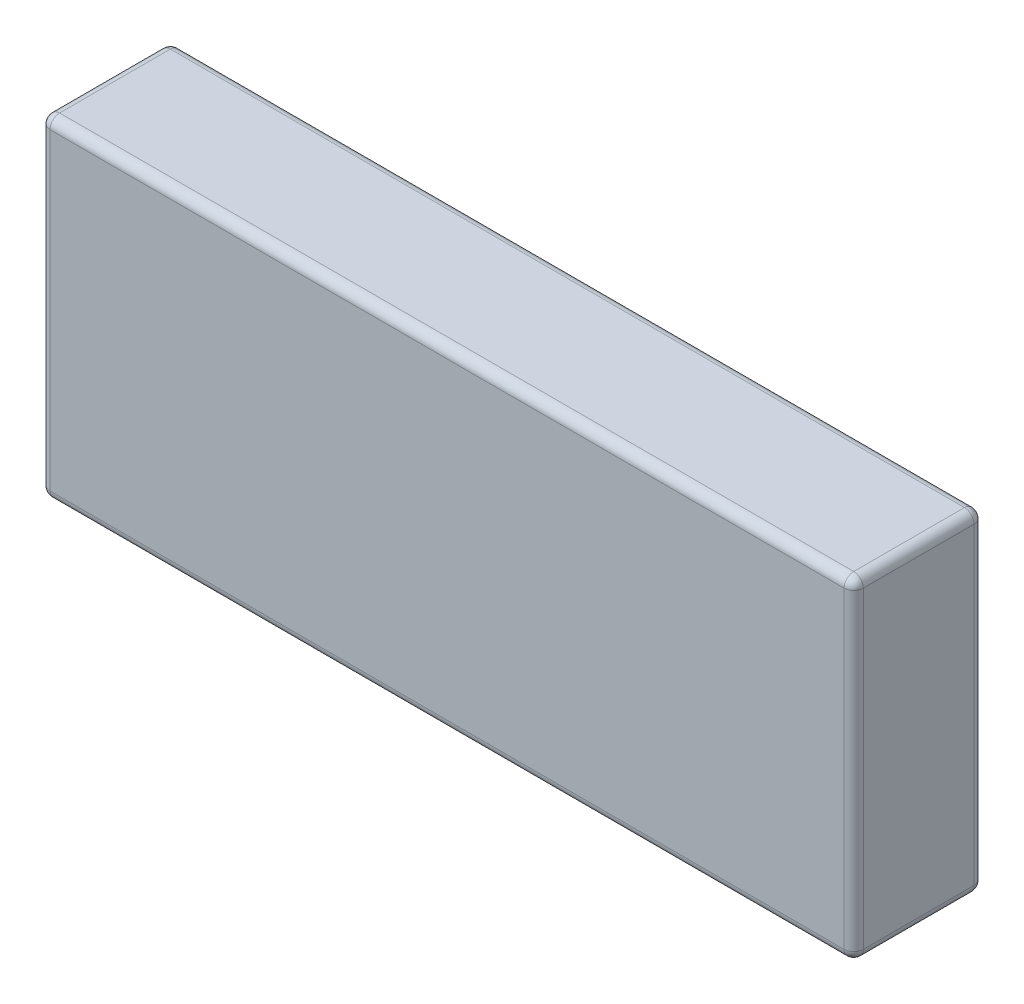
ISO-10303-21;
HEADER;
FILE_DESCRIPTION(('STEP AP214'),'2;1');
FILE_NAME('part.step','',(''),(''),'','','');
FILE_SCHEMA(('AUTOMOTIVE_DESIGN { 1 0 10303 214 1 1 1 1 }'));
ENDSEC;
DATA;
#1=APPLICATION_CONTEXT('core data for automotive mechanical design processes');
#2=APPLICATION_PROTOCOL_DEFINITION('international standard','automotive_design',2000,#1);
#3=PRODUCT_CONTEXT('',#1,'mechanical');
#4=PRODUCT('Part','Part','',(#3));
#5=PRODUCT_RELATED_PRODUCT_CATEGORY('part','',(#4));
#6=PRODUCT_DEFINITION_FORMATION('','',#4);
#7=PRODUCT_DEFINITION_CONTEXT('part definition',#1,'design');
#8=PRODUCT_DEFINITION('design','',#6,#7);
#9=PRODUCT_DEFINITION_SHAPE('','',#8);
#10=(LENGTH_UNIT() NAMED_UNIT(*) SI_UNIT(.MILLI.,.METRE.));
#11=(NAMED_UNIT(*) PLANE_ANGLE_UNIT() SI_UNIT($,.RADIAN.));
#12=(NAMED_UNIT(*) SI_UNIT($,.STERADIAN.) SOLID_ANGLE_UNIT());
#13=UNCERTAINTY_MEASURE_WITH_UNIT(LENGTH_MEASURE(1.E-05),#10,'distance_accuracy_value','');
#14=(GEOMETRIC_REPRESENTATION_CONTEXT(3) GLOBAL_UNCERTAINTY_ASSIGNED_CONTEXT((#13)) GLOBAL_UNIT_ASSIGNED_CONTEXT((#10,
#11,#12)) REPRESENTATION_CONTEXT('',''));
#15=CARTESIAN_POINT('',(0.,0.,0.));
#16=DIRECTION('',(0.,0.,1.));
#17=DIRECTION('',(1.,0.,0.));
#18=AXIS2_PLACEMENT_3D('',#15,#16,#17);
#19=CARTESIAN_POINT('',(0.,69.,0.));
#20=DIRECTION('',(1.,0.,0.));
#21=DIRECTION('',(0.,0.,-1.));
#22=AXIS2_PLACEMENT_3D('',#19,#20,#21);
#23=PLANE('',#22);
#24=DIRECTION('',(0.,0.,1.));
#25=VECTOR('',#24,1.);
#26=CARTESIAN_POINT('',(0.,2.,0.));
#27=LINE('',#26,#25);
#28=CARTESIAN_POINT('',(0.,2.,-25.));
#29=VERTEX_POINT('',#28);
#30=CARTESIAN_POINT('',(0.,2.,-2.));
#31=VERTEX_POINT('',#30);
#32=EDGE_CURVE('E181',#29,#31,#27,.T.);
#33=ORIENTED_EDGE('',*,*,#32,.T.);
#34=DIRECTION('',(0.,-1.,0.));
#35=VECTOR('',#34,1.);
#36=CARTESIAN_POINT('',(0.,69.,-2.));
#37=LINE('',#36,#35);
#38=CARTESIAN_POINT('',(0.,67.,-2.));
#39=VERTEX_POINT('',#38);
#40=EDGE_CURVE('E183',#31,#39,#37,.F.);
#41=ORIENTED_EDGE('',*,*,#40,.T.);
#42=DIRECTION('',(0.,0.,1.));
#43=VECTOR('',#42,1.);
#44=CARTESIAN_POINT('',(0.,67.,0.));
#45=LINE('',#44,#43);
#46=CARTESIAN_POINT('',(0.,67.,-25.));
#47=VERTEX_POINT('',#46);
#48=EDGE_CURVE('E179',#39,#47,#45,.F.);
#49=ORIENTED_EDGE('',*,*,#48,.T.);
#50=DIRECTION('',(0.,-1.,0.));
#51=VECTOR('',#50,1.);
#52=CARTESIAN_POINT('',(0.,69.,-25.));
#53=LINE('',#52,#51);
#54=EDGE_CURVE('E177',#47,#29,#53,.T.);
#55=ORIENTED_EDGE('',*,*,#54,.T.);
#56=EDGE_LOOP('',(#33,#41,#49,#55));
#57=FACE_BOUND('',#56,.T.);
#58=ADVANCED_FACE('F40',(#57),#23,.F.);
#59=CARTESIAN_POINT('',(0.,69.,0.));
#60=DIRECTION('',(0.,0.,-1.));
#61=DIRECTION('',(-1.,0.,0.));
#62=AXIS2_PLACEMENT_3D('',#59,#60,#61);
#63=PLANE('',#62);
#64=DIRECTION('',(0.,-1.,0.));
#65=VECTOR('',#64,1.);
#66=CARTESIAN_POINT('',(2.,69.,0.));
#67=LINE('',#66,#65);
#68=CARTESIAN_POINT('',(2.,67.,0.));
#69=VERTEX_POINT('',#68);
#70=CARTESIAN_POINT('',(2.,2.,0.));
#71=VERTEX_POINT('',#70);
#72=EDGE_CURVE('E143',#69,#71,#67,.T.);
#73=ORIENTED_EDGE('',*,*,#72,.T.);
#74=DIRECTION('',(1.,0.,0.));
#75=VECTOR('',#74,1.);
#76=CARTESIAN_POINT('',(169.,2.,0.));
#77=LINE('',#76,#75);
#78=CARTESIAN_POINT('',(167.,2.,0.));
#79=VERTEX_POINT('',#78);
#80=EDGE_CURVE('E138',#71,#79,#77,.T.);
#81=ORIENTED_EDGE('',*,*,#80,.T.);
#82=DIRECTION('',(0.,-1.,0.));
#83=VECTOR('',#82,1.);
#84=CARTESIAN_POINT('',(167.,69.,0.));
#85=LINE('',#84,#83);
#86=CARTESIAN_POINT('',(167.,67.,0.));
#87=VERTEX_POINT('',#86);
#88=EDGE_CURVE('E130',#79,#87,#85,.F.);
#89=ORIENTED_EDGE('',*,*,#88,.T.);
#90=DIRECTION('',(1.,0.,0.));
#91=VECTOR('',#90,1.);
#92=CARTESIAN_POINT('',(0.,67.,0.));
#93=LINE('',#92,#91);
#94=EDGE_CURVE('E135',#87,#69,#93,.F.);
#95=ORIENTED_EDGE('',*,*,#94,.T.);
#96=EDGE_LOOP('',(#73,#81,#89,#95));
#97=FACE_BOUND('',#96,.T.);
#98=ADVANCED_FACE('F133',(#97),#63,.F.);
#99=CARTESIAN_POINT('',(169.,69.,0.));
#100=DIRECTION('',(-1.,0.,0.));
#101=DIRECTION('',(0.,0.,1.));
#102=AXIS2_PLACEMENT_3D('',#99,#100,#101);
#103=PLANE('',#102);
#104=DIRECTION('',(0.,0.,-1.));
#105=VECTOR('',#104,1.);
#106=CARTESIAN_POINT('',(169.,67.,0.));
#107=LINE('',#106,#105);
#108=CARTESIAN_POINT('',(169.,67.,-25.));
#109=VERTEX_POINT('',#108);
#110=CARTESIAN_POINT('',(169.,67.,-2.));
#111=VERTEX_POINT('',#110);
#112=EDGE_CURVE('E188',#109,#111,#107,.F.);
#113=ORIENTED_EDGE('',*,*,#112,.T.);
#114=DIRECTION('',(0.,-1.,0.));
#115=VECTOR('',#114,1.);
#116=CARTESIAN_POINT('',(169.,69.,-2.));
#117=LINE('',#116,#115);
#118=CARTESIAN_POINT('',(169.,2.,-2.));
#119=VERTEX_POINT('',#118);
#120=EDGE_CURVE('E151',#111,#119,#117,.T.);
#121=ORIENTED_EDGE('',*,*,#120,.T.);
#122=DIRECTION('',(0.,0.,-1.));
#123=VECTOR('',#122,1.);
#124=CARTESIAN_POINT('',(169.,2.,-27.));
#125=LINE('',#124,#123);
#126=CARTESIAN_POINT('',(169.,2.,-25.));
#127=VERTEX_POINT('',#126);
#128=EDGE_CURVE('E190',#119,#127,#125,.T.);
#129=ORIENTED_EDGE('',*,*,#128,.T.);
#130=DIRECTION('',(0.,-1.,0.));
#131=VECTOR('',#130,1.);
#132=CARTESIAN_POINT('',(169.,69.,-25.));
#133=LINE('',#132,#131);
#134=EDGE_CURVE('E186',#127,#109,#133,.F.);
#135=ORIENTED_EDGE('',*,*,#134,.T.);
#136=EDGE_LOOP('',(#113,#121,#129,#135));
#137=FACE_BOUND('',#136,.T.);
#138=ADVANCED_FACE('F351',(#137),#103,.F.);
#139=CARTESIAN_POINT('',(0.,69.,-27.));
#140=DIRECTION('',(0.,0.,1.));
#141=DIRECTION('',(1.,0.,0.));
#142=AXIS2_PLACEMENT_3D('',#139,#140,#141);
#143=PLANE('',#142);
#144=DIRECTION('',(-1.,0.,0.));
#145=VECTOR('',#144,1.);
#146=CARTESIAN_POINT('',(0.,67.,-27.));
#147=LINE('',#146,#145);
#148=CARTESIAN_POINT('',(2.,67.,-27.));
#149=VERTEX_POINT('',#148);
#150=CARTESIAN_POINT('',(167.,67.,-27.));
#151=VERTEX_POINT('',#150);
#152=EDGE_CURVE('E49',#149,#151,#147,.F.);
#153=ORIENTED_EDGE('',*,*,#152,.T.);
#154=DIRECTION('',(0.,-1.,0.));
#155=VECTOR('',#154,1.);
#156=CARTESIAN_POINT('',(167.,69.,-27.));
#157=LINE('',#156,#155);
#158=CARTESIAN_POINT('',(167.,2.,-27.));
#159=VERTEX_POINT('',#158);
#160=EDGE_CURVE('E11',#151,#159,#157,.T.);
#161=ORIENTED_EDGE('',*,*,#160,.T.);
#162=DIRECTION('',(-1.,0.,0.));
#163=VECTOR('',#162,1.);
#164=CARTESIAN_POINT('',(0.,2.,-27.));
#165=LINE('',#164,#163);
#166=CARTESIAN_POINT('',(2.,2.,-27.));
#167=VERTEX_POINT('',#166);
#168=EDGE_CURVE('E215',#159,#167,#165,.T.);
#169=ORIENTED_EDGE('',*,*,#168,.T.);
#170=DIRECTION('',(0.,-1.,0.));
#171=VECTOR('',#170,1.);
#172=CARTESIAN_POINT('',(2.,69.,-27.));
#173=LINE('',#172,#171);
#174=EDGE_CURVE('E60',#167,#149,#173,.F.);
#175=ORIENTED_EDGE('',*,*,#174,.T.);
#176=EDGE_LOOP('',(#153,#161,#169,#175));
#177=FACE_BOUND('',#176,.T.);
#178=ADVANCED_FACE('F291',(#177),#143,.F.);
#179=CARTESIAN_POINT('',(0.,69.,-27.));
#180=DIRECTION('',(0.,-1.,0.));
#181=DIRECTION('',(0.,0.,-1.));
#182=AXIS2_PLACEMENT_3D('',#179,#180,#181);
#183=PLANE('',#182);
#184=DIRECTION('',(1.,0.,0.));
#185=VECTOR('',#184,1.);
#186=CARTESIAN_POINT('',(0.,69.,-2.));
#187=LINE('',#186,#185);
#188=CARTESIAN_POINT('',(2.,69.,-2.));
#189=VERTEX_POINT('',#188);
#190=CARTESIAN_POINT('',(167.,69.,-2.));
#191=VERTEX_POINT('',#190);
#192=EDGE_CURVE('E210',#189,#191,#187,.T.);
#193=ORIENTED_EDGE('',*,*,#192,.T.);
#194=DIRECTION('',(0.,0.,-1.));
#195=VECTOR('',#194,1.);
#196=CARTESIAN_POINT('',(167.,69.,-27.));
#197=LINE('',#196,#195);
#198=CARTESIAN_POINT('',(167.,69.,-25.));
#199=VERTEX_POINT('',#198);
#200=EDGE_CURVE('E212',#191,#199,#197,.T.);
#201=ORIENTED_EDGE('',*,*,#200,.T.);
#202=DIRECTION('',(-1.,0.,0.));
#203=VECTOR('',#202,1.);
#204=CARTESIAN_POINT('',(0.,69.,-25.));
#205=LINE('',#204,#203);
#206=CARTESIAN_POINT('',(2.,69.,-25.));
#207=VERTEX_POINT('',#206);
#208=EDGE_CURVE('E206',#199,#207,#205,.T.);
#209=ORIENTED_EDGE('',*,*,#208,.T.);
#210=DIRECTION('',(0.,0.,1.));
#211=VECTOR('',#210,1.);
#212=CARTESIAN_POINT('',(2.,69.,-27.));
#213=LINE('',#212,#211);
#214=EDGE_CURVE('E208',#207,#189,#213,.T.);
#215=ORIENTED_EDGE('',*,*,#214,.T.);
#216=EDGE_LOOP('',(#193,#201,#209,#215));
#217=FACE_BOUND('',#216,.T.);
#218=ADVANCED_FACE('F315',(#217),#183,.F.);
#219=CARTESIAN_POINT('',(0.,0.,-27.));
#220=DIRECTION('',(0.,-1.,0.));
#221=DIRECTION('',(0.,0.,-1.));
#222=AXIS2_PLACEMENT_3D('',#219,#220,#221);
#223=PLANE('',#222);
#224=DIRECTION('',(0.,0.,-1.));
#225=VECTOR('',#224,1.);
#226=CARTESIAN_POINT('',(167.,0.,0.));
#227=LINE('',#226,#225);
#228=CARTESIAN_POINT('',(167.,0.,-25.));
#229=VERTEX_POINT('',#228);
#230=CARTESIAN_POINT('',(167.,0.,-2.));
#231=VERTEX_POINT('',#230);
#232=EDGE_CURVE('E199',#229,#231,#227,.F.);
#233=ORIENTED_EDGE('',*,*,#232,.T.);
#234=DIRECTION('',(1.,0.,0.));
#235=VECTOR('',#234,1.);
#236=CARTESIAN_POINT('',(0.,0.,-2.));
#237=LINE('',#236,#235);
#238=CARTESIAN_POINT('',(2.,0.,-2.));
#239=VERTEX_POINT('',#238);
#240=EDGE_CURVE('E202',#231,#239,#237,.F.);
#241=ORIENTED_EDGE('',*,*,#240,.T.);
#242=DIRECTION('',(0.,0.,1.));
#243=VECTOR('',#242,1.);
#244=CARTESIAN_POINT('',(2.,0.,-27.));
#245=LINE('',#244,#243);
#246=CARTESIAN_POINT('',(2.,0.,-25.));
#247=VERTEX_POINT('',#246);
#248=EDGE_CURVE('E197',#239,#247,#245,.F.);
#249=ORIENTED_EDGE('',*,*,#248,.T.);
#250=DIRECTION('',(-1.,0.,0.));
#251=VECTOR('',#250,1.);
#252=CARTESIAN_POINT('',(169.,0.,-25.));
#253=LINE('',#252,#251);
#254=EDGE_CURVE('E195',#247,#229,#253,.F.);
#255=ORIENTED_EDGE('',*,*,#254,.T.);
#256=EDGE_LOOP('',(#233,#241,#249,#255));
#257=FACE_BOUND('',#256,.T.);
#258=ADVANCED_FACE('F284',(#257),#223,.T.);
#259=CARTESIAN_POINT('',(167.,69.,-25.));
#260=DIRECTION('',(0.,-1.,0.));
#261=DIRECTION('',(0.,0.,-1.));
#262=AXIS2_PLACEMENT_3D('',#259,#260,#261);
#263=CYLINDRICAL_SURFACE('',#262,2.);
#264=CARTESIAN_POINT('',(167.,67.,-25.));
#265=DIRECTION('',(0.,1.,0.));
#266=DIRECTION('',(0.,0.,1.));
#267=AXIS2_PLACEMENT_3D('',#264,#265,#266);
#268=CIRCLE('',#267,2.);
#269=EDGE_CURVE('E44',#109,#151,#268,.T.);
#270=ORIENTED_EDGE('',*,*,#269,.F.);
#271=ORIENTED_EDGE('',*,*,#134,.F.);
#272=CARTESIAN_POINT('',(167.,2.,-25.));
#273=DIRECTION('',(0.,-1.,0.));
#274=DIRECTION('',(0.,0.,-1.));
#275=AXIS2_PLACEMENT_3D('',#272,#273,#274);
#276=CIRCLE('',#275,2.);
#277=EDGE_CURVE('E172',#159,#127,#276,.T.);
#278=ORIENTED_EDGE('',*,*,#277,.F.);
#279=ORIENTED_EDGE('',*,*,#160,.F.);
#280=EDGE_LOOP('',(#270,#271,#278,#279));
#281=FACE_BOUND('',#280,.T.);
#282=ADVANCED_FACE('F42',(#281),#263,.T.);
#283=CARTESIAN_POINT('',(167.,67.,-25.));
#284=DIRECTION('',(0.,0.,1.));
#285=DIRECTION('',(1.,0.,0.));
#286=AXIS2_PLACEMENT_3D('',#283,#284,#285);
#287=SPHERICAL_SURFACE('',#286,2.);
#288=CARTESIAN_POINT('',(167.,67.,-25.));
#289=DIRECTION('',(0.,0.,-1.));
#290=DIRECTION('',(-1.,0.,0.));
#291=AXIS2_PLACEMENT_3D('',#288,#289,#290);
#292=CIRCLE('',#291,2.);
#293=EDGE_CURVE('E264',#109,#199,#292,.F.);
#294=ORIENTED_EDGE('',*,*,#293,.F.);
#295=ORIENTED_EDGE('',*,*,#269,.T.);
#296=CARTESIAN_POINT('',(167.,67.,-25.));
#297=DIRECTION('',(1.,0.,0.));
#298=DIRECTION('',(0.,0.,-1.));
#299=AXIS2_PLACEMENT_3D('',#296,#297,#298);
#300=CIRCLE('',#299,2.);
#301=EDGE_CURVE('E267',#199,#151,#300,.F.);
#302=ORIENTED_EDGE('',*,*,#301,.F.);
#303=EDGE_LOOP('',(#294,#295,#302));
#304=FACE_BOUND('',#303,.T.);
#305=ADVANCED_FACE('F308',(#304),#287,.T.);
#306=CARTESIAN_POINT('',(167.,2.,-25.));
#307=DIRECTION('',(0.,0.,1.));
#308=DIRECTION('',(1.,0.,0.));
#309=AXIS2_PLACEMENT_3D('',#306,#307,#308);
#310=SPHERICAL_SURFACE('',#309,2.);
#311=CARTESIAN_POINT('',(167.,2.,-25.));
#312=DIRECTION('',(1.,0.,0.));
#313=DIRECTION('',(0.,0.,-1.));
#314=AXIS2_PLACEMENT_3D('',#311,#312,#313);
#315=CIRCLE('',#314,2.);
#316=EDGE_CURVE('E258',#159,#229,#315,.F.);
#317=ORIENTED_EDGE('',*,*,#316,.F.);
#318=ORIENTED_EDGE('',*,*,#277,.T.);
#319=CARTESIAN_POINT('',(167.,2.,-25.));
#320=DIRECTION('',(0.,0.,-1.));
#321=DIRECTION('',(-1.,0.,0.));
#322=AXIS2_PLACEMENT_3D('',#319,#320,#321);
#323=CIRCLE('',#322,2.);
#324=EDGE_CURVE('E261',#229,#127,#323,.F.);
#325=ORIENTED_EDGE('',*,*,#324,.F.);
#326=EDGE_LOOP('',(#317,#318,#325));
#327=FACE_BOUND('',#326,.T.);
#328=ADVANCED_FACE('F274',(#327),#310,.T.);
#329=CARTESIAN_POINT('',(0.,67.,-25.));
#330=DIRECTION('',(-1.,0.,0.));
#331=DIRECTION('',(0.,0.,1.));
#332=AXIS2_PLACEMENT_3D('',#329,#330,#331);
#333=CYLINDRICAL_SURFACE('',#332,2.);
#334=ORIENTED_EDGE('',*,*,#301,.T.);
#335=ORIENTED_EDGE('',*,*,#152,.F.);
#336=CARTESIAN_POINT('',(2.,67.,-25.));
#337=DIRECTION('',(-1.,0.,0.));
#338=DIRECTION('',(0.,0.,1.));
#339=AXIS2_PLACEMENT_3D('',#336,#337,#338);
#340=CIRCLE('',#339,2.);
#341=EDGE_CURVE('E252',#207,#149,#340,.T.);
#342=ORIENTED_EDGE('',*,*,#341,.F.);
#343=ORIENTED_EDGE('',*,*,#208,.F.);
#344=EDGE_LOOP('',(#334,#335,#342,#343));
#345=FACE_BOUND('',#344,.T.);
#346=ADVANCED_FACE('F304',(#345),#333,.T.);
#347=CARTESIAN_POINT('',(167.,67.,-27.));
#348=DIRECTION('',(0.,0.,-1.));
#349=DIRECTION('',(-1.,0.,0.));
#350=AXIS2_PLACEMENT_3D('',#347,#348,#349);
#351=CYLINDRICAL_SURFACE('',#350,2.);
#352=ORIENTED_EDGE('',*,*,#293,.T.);
#353=ORIENTED_EDGE('',*,*,#200,.F.);
#354=CARTESIAN_POINT('',(167.,67.,-2.));
#355=DIRECTION('',(0.,0.,1.));
#356=DIRECTION('',(0.,-1.,0.));
#357=AXIS2_PLACEMENT_3D('',#354,#355,#356);
#358=CIRCLE('',#357,2.);
#359=EDGE_CURVE('E155',#111,#191,#358,.T.);
#360=ORIENTED_EDGE('',*,*,#359,.F.);
#361=ORIENTED_EDGE('',*,*,#112,.F.);
#362=EDGE_LOOP('',(#352,#353,#360,#361));
#363=FACE_BOUND('',#362,.T.);
#364=ADVANCED_FACE('F313',(#363),#351,.T.);
#365=CARTESIAN_POINT('',(167.,69.,-2.));
#366=DIRECTION('',(0.,-1.,0.));
#367=DIRECTION('',(0.,0.,-1.));
#368=AXIS2_PLACEMENT_3D('',#365,#366,#367);
#369=CYLINDRICAL_SURFACE('',#368,2.);
#370=CARTESIAN_POINT('',(167.,2.,-2.));
#371=DIRECTION('',(0.,-1.,0.));
#372=DIRECTION('',(0.,0.,-1.));
#373=AXIS2_PLACEMENT_3D('',#370,#371,#372);
#374=CIRCLE('',#373,2.);
#375=EDGE_CURVE('E156',#119,#79,#374,.T.);
#376=ORIENTED_EDGE('',*,*,#375,.F.);
#377=ORIENTED_EDGE('',*,*,#120,.F.);
#378=CARTESIAN_POINT('',(167.,67.,-2.));
#379=DIRECTION('',(0.,1.,0.));
#380=DIRECTION('',(0.,0.,1.));
#381=AXIS2_PLACEMENT_3D('',#378,#379,#380);
#382=CIRCLE('',#381,2.);
#383=EDGE_CURVE('E147',#87,#111,#382,.T.);
#384=ORIENTED_EDGE('',*,*,#383,.F.);
#385=ORIENTED_EDGE('',*,*,#88,.F.);
#386=EDGE_LOOP('',(#376,#377,#384,#385));
#387=FACE_BOUND('',#386,.T.);
#388=ADVANCED_FACE('F149',(#387),#369,.T.);
#389=CARTESIAN_POINT('',(167.,2.,0.));
#390=DIRECTION('',(0.,0.,1.));
#391=DIRECTION('',(1.,0.,0.));
#392=AXIS2_PLACEMENT_3D('',#389,#390,#391);
#393=CYLINDRICAL_SURFACE('',#392,2.);
#394=ORIENTED_EDGE('',*,*,#324,.T.);
#395=ORIENTED_EDGE('',*,*,#128,.F.);
#396=CARTESIAN_POINT('',(167.,2.,-2.));
#397=DIRECTION('',(0.,0.,1.));
#398=DIRECTION('',(1.,0.,0.));
#399=AXIS2_PLACEMENT_3D('',#396,#397,#398);
#400=CIRCLE('',#399,2.);
#401=EDGE_CURVE('E246',#231,#119,#400,.T.);
#402=ORIENTED_EDGE('',*,*,#401,.F.);
#403=ORIENTED_EDGE('',*,*,#232,.F.);
#404=EDGE_LOOP('',(#394,#395,#402,#403));
#405=FACE_BOUND('',#404,.T.);
#406=ADVANCED_FACE('F280',(#405),#393,.T.);
#407=CARTESIAN_POINT('',(0.,2.,-25.));
#408=DIRECTION('',(1.,0.,0.));
#409=DIRECTION('',(0.,0.,-1.));
#410=AXIS2_PLACEMENT_3D('',#407,#408,#409);
#411=CYLINDRICAL_SURFACE('',#410,2.);
#412=ORIENTED_EDGE('',*,*,#316,.T.);
#413=ORIENTED_EDGE('',*,*,#254,.F.);
#414=CARTESIAN_POINT('',(2.,2.,-25.));
#415=DIRECTION('',(-1.,0.,0.));
#416=DIRECTION('',(0.,0.,1.));
#417=AXIS2_PLACEMENT_3D('',#414,#415,#416);
#418=CIRCLE('',#417,2.);
#419=EDGE_CURVE('E243',#167,#247,#418,.T.);
#420=ORIENTED_EDGE('',*,*,#419,.F.);
#421=ORIENTED_EDGE('',*,*,#168,.F.);
#422=EDGE_LOOP('',(#412,#413,#420,#421));
#423=FACE_BOUND('',#422,.T.);
#424=ADVANCED_FACE('F290',(#423),#411,.T.);
#425=CARTESIAN_POINT('',(2.,69.,-25.));
#426=DIRECTION('',(0.,-1.,0.));
#427=DIRECTION('',(0.,0.,-1.));
#428=AXIS2_PLACEMENT_3D('',#425,#426,#427);
#429=CYLINDRICAL_SURFACE('',#428,2.);
#430=CARTESIAN_POINT('',(2.,67.,-25.));
#431=DIRECTION('',(0.,1.,0.));
#432=DIRECTION('',(0.,0.,1.));
#433=AXIS2_PLACEMENT_3D('',#430,#431,#432);
#434=CIRCLE('',#433,2.);
#435=EDGE_CURVE('E255',#149,#47,#434,.T.);
#436=ORIENTED_EDGE('',*,*,#435,.F.);
#437=ORIENTED_EDGE('',*,*,#174,.F.);
#438=CARTESIAN_POINT('',(2.,2.,-25.));
#439=DIRECTION('',(0.,-1.,0.));
#440=DIRECTION('',(0.,0.,-1.));
#441=AXIS2_PLACEMENT_3D('',#438,#439,#440);
#442=CIRCLE('',#441,2.);
#443=EDGE_CURVE('E240',#29,#167,#442,.T.);
#444=ORIENTED_EDGE('',*,*,#443,.F.);
#445=ORIENTED_EDGE('',*,*,#54,.F.);
#446=EDGE_LOOP('',(#436,#437,#444,#445));
#447=FACE_BOUND('',#446,.T.);
#448=ADVANCED_FACE('F295',(#447),#429,.T.);
#449=CARTESIAN_POINT('',(2.,67.,-25.));
#450=DIRECTION('',(0.,0.,1.));
#451=DIRECTION('',(1.,0.,0.));
#452=AXIS2_PLACEMENT_3D('',#449,#450,#451);
#453=SPHERICAL_SURFACE('',#452,2.);
#454=ORIENTED_EDGE('',*,*,#341,.T.);
#455=ORIENTED_EDGE('',*,*,#435,.T.);
#456=CARTESIAN_POINT('',(2.,67.,-25.));
#457=DIRECTION('',(0.,0.,-1.));
#458=DIRECTION('',(-1.,0.,0.));
#459=AXIS2_PLACEMENT_3D('',#456,#457,#458);
#460=CIRCLE('',#459,2.);
#461=EDGE_CURVE('E163',#207,#47,#460,.F.);
#462=ORIENTED_EDGE('',*,*,#461,.F.);
#463=EDGE_LOOP('',(#454,#455,#462));
#464=FACE_BOUND('',#463,.T.);
#465=ADVANCED_FACE('F301',(#464),#453,.T.);
#466=CARTESIAN_POINT('',(167.,67.,-2.));
#467=DIRECTION('',(0.,0.,1.));
#468=DIRECTION('',(1.,0.,0.));
#469=AXIS2_PLACEMENT_3D('',#466,#467,#468);
#470=SPHERICAL_SURFACE('',#469,2.);
#471=ORIENTED_EDGE('',*,*,#383,.T.);
#472=ORIENTED_EDGE('',*,*,#359,.T.);
#473=CARTESIAN_POINT('',(167.,67.,-2.));
#474=DIRECTION('',(1.,0.,0.));
#475=DIRECTION('',(0.,0.,-1.));
#476=AXIS2_PLACEMENT_3D('',#473,#474,#475);
#477=CIRCLE('',#476,2.);
#478=EDGE_CURVE('E159',#87,#191,#477,.F.);
#479=ORIENTED_EDGE('',*,*,#478,.F.);
#480=EDGE_LOOP('',(#471,#472,#479));
#481=FACE_BOUND('',#480,.T.);
#482=ADVANCED_FACE('F160',(#481),#470,.T.);
#483=CARTESIAN_POINT('',(167.,2.,-2.));
#484=DIRECTION('',(0.,0.,1.));
#485=DIRECTION('',(1.,0.,0.));
#486=AXIS2_PLACEMENT_3D('',#483,#484,#485);
#487=SPHERICAL_SURFACE('',#486,2.);
#488=ORIENTED_EDGE('',*,*,#401,.T.);
#489=ORIENTED_EDGE('',*,*,#375,.T.);
#490=CARTESIAN_POINT('',(167.,2.,-2.));
#491=DIRECTION('',(1.,0.,0.));
#492=DIRECTION('',(0.,0.,-1.));
#493=AXIS2_PLACEMENT_3D('',#490,#491,#492);
#494=CIRCLE('',#493,2.);
#495=EDGE_CURVE('E164',#231,#79,#494,.F.);
#496=ORIENTED_EDGE('',*,*,#495,.F.);
#497=EDGE_LOOP('',(#488,#489,#496));
#498=FACE_BOUND('',#497,.T.);
#499=ADVANCED_FACE('F334',(#498),#487,.T.);
#500=CARTESIAN_POINT('',(2.,2.,-25.));
#501=DIRECTION('',(0.,0.,1.));
#502=DIRECTION('',(1.,0.,0.));
#503=AXIS2_PLACEMENT_3D('',#500,#501,#502);
#504=SPHERICAL_SURFACE('',#503,2.);
#505=ORIENTED_EDGE('',*,*,#443,.T.);
#506=ORIENTED_EDGE('',*,*,#419,.T.);
#507=CARTESIAN_POINT('',(2.,2.,-25.));
#508=DIRECTION('',(0.,0.,-1.));
#509=DIRECTION('',(-1.,0.,0.));
#510=AXIS2_PLACEMENT_3D('',#507,#508,#509);
#511=CIRCLE('',#510,2.);
#512=EDGE_CURVE('E232',#29,#247,#511,.F.);
#513=ORIENTED_EDGE('',*,*,#512,.F.);
#514=EDGE_LOOP('',(#505,#506,#513));
#515=FACE_BOUND('',#514,.T.);
#516=ADVANCED_FACE('F336',(#515),#504,.T.);
#517=CARTESIAN_POINT('',(2.,67.,-27.));
#518=DIRECTION('',(0.,0.,1.));
#519=DIRECTION('',(1.,0.,0.));
#520=AXIS2_PLACEMENT_3D('',#517,#518,#519);
#521=CYLINDRICAL_SURFACE('',#520,2.);
#522=ORIENTED_EDGE('',*,*,#461,.T.);
#523=ORIENTED_EDGE('',*,*,#48,.F.);
#524=CARTESIAN_POINT('',(2.,67.,-2.));
#525=DIRECTION('',(0.,0.,1.));
#526=DIRECTION('',(1.,0.,0.));
#527=AXIS2_PLACEMENT_3D('',#524,#525,#526);
#528=CIRCLE('',#527,2.);
#529=EDGE_CURVE('E229',#189,#39,#528,.T.);
#530=ORIENTED_EDGE('',*,*,#529,.F.);
#531=ORIENTED_EDGE('',*,*,#214,.F.);
#532=EDGE_LOOP('',(#522,#523,#530,#531));
#533=FACE_BOUND('',#532,.T.);
#534=ADVANCED_FACE('F319',(#533),#521,.T.);
#535=CARTESIAN_POINT('',(0.,67.,-2.));
#536=DIRECTION('',(1.,0.,0.));
#537=DIRECTION('',(0.,0.,-1.));
#538=AXIS2_PLACEMENT_3D('',#535,#536,#537);
#539=CYLINDRICAL_SURFACE('',#538,2.);
#540=ORIENTED_EDGE('',*,*,#478,.T.);
#541=ORIENTED_EDGE('',*,*,#192,.F.);
#542=CARTESIAN_POINT('',(2.,67.,-2.));
#543=DIRECTION('',(-1.,0.,0.));
#544=DIRECTION('',(0.,0.,1.));
#545=AXIS2_PLACEMENT_3D('',#542,#543,#544);
#546=CIRCLE('',#545,2.);
#547=EDGE_CURVE('E168',#69,#189,#546,.T.);
#548=ORIENTED_EDGE('',*,*,#547,.F.);
#549=ORIENTED_EDGE('',*,*,#94,.F.);
#550=EDGE_LOOP('',(#540,#541,#548,#549));
#551=FACE_BOUND('',#550,.T.);
#552=ADVANCED_FACE('F166',(#551),#539,.T.);
#553=CARTESIAN_POINT('',(0.,2.,-2.));
#554=DIRECTION('',(-1.,0.,0.));
#555=DIRECTION('',(0.,0.,1.));
#556=AXIS2_PLACEMENT_3D('',#553,#554,#555);
#557=CYLINDRICAL_SURFACE('',#556,2.);
#558=ORIENTED_EDGE('',*,*,#495,.T.);
#559=ORIENTED_EDGE('',*,*,#80,.F.);
#560=CARTESIAN_POINT('',(2.,2.,-2.));
#561=DIRECTION('',(-1.,0.,0.));
#562=DIRECTION('',(0.,0.,1.));
#563=AXIS2_PLACEMENT_3D('',#560,#561,#562);
#564=CIRCLE('',#563,2.);
#565=EDGE_CURVE('E225',#239,#71,#564,.T.);
#566=ORIENTED_EDGE('',*,*,#565,.F.);
#567=ORIENTED_EDGE('',*,*,#240,.F.);
#568=EDGE_LOOP('',(#558,#559,#566,#567));
#569=FACE_BOUND('',#568,.T.);
#570=ADVANCED_FACE('F332',(#569),#557,.T.);
#571=CARTESIAN_POINT('',(2.,2.,0.));
#572=DIRECTION('',(0.,0.,-1.));
#573=DIRECTION('',(-1.,0.,0.));
#574=AXIS2_PLACEMENT_3D('',#571,#572,#573);
#575=CYLINDRICAL_SURFACE('',#574,2.);
#576=ORIENTED_EDGE('',*,*,#512,.T.);
#577=ORIENTED_EDGE('',*,*,#248,.F.);
#578=CARTESIAN_POINT('',(2.,2.,-2.));
#579=DIRECTION('',(0.,0.,1.));
#580=DIRECTION('',(1.,0.,0.));
#581=AXIS2_PLACEMENT_3D('',#578,#579,#580);
#582=CIRCLE('',#581,2.);
#583=EDGE_CURVE('E223',#31,#239,#582,.T.);
#584=ORIENTED_EDGE('',*,*,#583,.F.);
#585=ORIENTED_EDGE('',*,*,#32,.F.);
#586=EDGE_LOOP('',(#576,#577,#584,#585));
#587=FACE_BOUND('',#586,.T.);
#588=ADVANCED_FACE('F361',(#587),#575,.T.);
#589=CARTESIAN_POINT('',(2.,67.,-2.));
#590=DIRECTION('',(0.,0.,1.));
#591=DIRECTION('',(1.,0.,0.));
#592=AXIS2_PLACEMENT_3D('',#589,#590,#591);
#593=SPHERICAL_SURFACE('',#592,2.);
#594=ORIENTED_EDGE('',*,*,#547,.T.);
#595=ORIENTED_EDGE('',*,*,#529,.T.);
#596=CARTESIAN_POINT('',(2.,67.,-2.));
#597=DIRECTION('',(0.,1.,0.));
#598=DIRECTION('',(0.,0.,1.));
#599=AXIS2_PLACEMENT_3D('',#596,#597,#598);
#600=CIRCLE('',#599,2.);
#601=EDGE_CURVE('E221',#69,#39,#600,.F.);
#602=ORIENTED_EDGE('',*,*,#601,.F.);
#603=EDGE_LOOP('',(#594,#595,#602));
#604=FACE_BOUND('',#603,.T.);
#605=ADVANCED_FACE('F321',(#604),#593,.T.);
#606=CARTESIAN_POINT('',(2.,2.,-2.));
#607=DIRECTION('',(0.,0.,1.));
#608=DIRECTION('',(1.,0.,0.));
#609=AXIS2_PLACEMENT_3D('',#606,#607,#608);
#610=SPHERICAL_SURFACE('',#609,2.);
#611=ORIENTED_EDGE('',*,*,#583,.T.);
#612=ORIENTED_EDGE('',*,*,#565,.T.);
#613=CARTESIAN_POINT('',(2.,2.,-2.));
#614=DIRECTION('',(0.,-1.,0.));
#615=DIRECTION('',(0.,0.,-1.));
#616=AXIS2_PLACEMENT_3D('',#613,#614,#615);
#617=CIRCLE('',#616,2.);
#618=EDGE_CURVE('E219',#31,#71,#617,.F.);
#619=ORIENTED_EDGE('',*,*,#618,.F.);
#620=EDGE_LOOP('',(#611,#612,#619));
#621=FACE_BOUND('',#620,.T.);
#622=ADVANCED_FACE('F329',(#621),#610,.T.);
#623=CARTESIAN_POINT('',(2.,69.,-2.));
#624=DIRECTION('',(0.,-1.,0.));
#625=DIRECTION('',(0.,0.,-1.));
#626=AXIS2_PLACEMENT_3D('',#623,#624,#625);
#627=CYLINDRICAL_SURFACE('',#626,2.);
#628=ORIENTED_EDGE('',*,*,#601,.T.);
#629=ORIENTED_EDGE('',*,*,#40,.F.);
#630=ORIENTED_EDGE('',*,*,#618,.T.);
#631=ORIENTED_EDGE('',*,*,#72,.F.);
#632=EDGE_LOOP('',(#628,#629,#630,#631));
#633=FACE_BOUND('',#632,.T.);
#634=ADVANCED_FACE('F325',(#633),#627,.T.);
#635=CLOSED_SHELL('',(#58,#98,#138,#178,#218,#258,#282,#305,#328,#346,#364,#388,#406,#424,#448,
#465,#482,#499,#516,#534,#552,#570,#588,#605,#622,#634));
#636=MANIFOLD_SOLID_BREP('B2',#635);
#637=ADVANCED_BREP_SHAPE_REPRESENTATION('',(#18,#636),#14);
#638=SHAPE_DEFINITION_REPRESENTATION(#9,#637);
ENDSEC;
END-ISO-10303-21;
